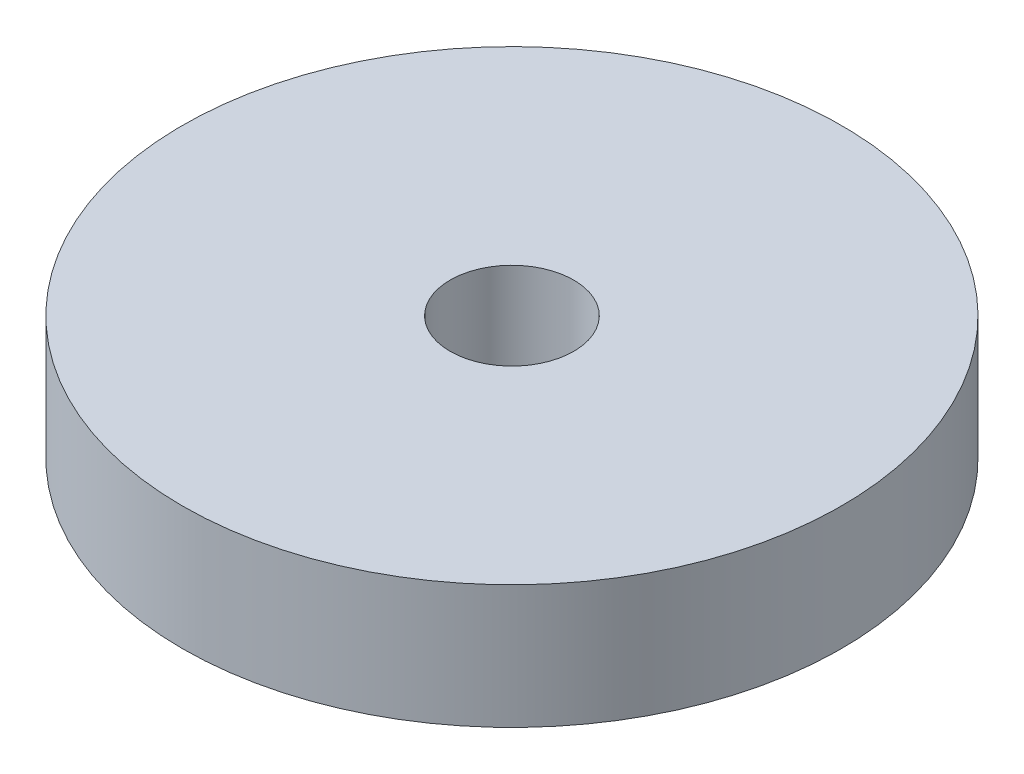
ISO-10303-21;
HEADER;
FILE_DESCRIPTION(('STEP AP214'),'2;1');
FILE_NAME('part.step','',(''),(''),'','','');
FILE_SCHEMA(('AUTOMOTIVE_DESIGN { 1 0 10303 214 1 1 1 1 }'));
ENDSEC;
DATA;
#1=APPLICATION_CONTEXT('core data for automotive mechanical design processes');
#2=APPLICATION_PROTOCOL_DEFINITION('international standard','automotive_design',2000,#1);
#3=PRODUCT_CONTEXT('',#1,'mechanical');
#4=PRODUCT('Part','Part','',(#3));
#5=PRODUCT_RELATED_PRODUCT_CATEGORY('part','',(#4));
#6=PRODUCT_DEFINITION_FORMATION('','',#4);
#7=PRODUCT_DEFINITION_CONTEXT('part definition',#1,'design');
#8=PRODUCT_DEFINITION('design','',#6,#7);
#9=PRODUCT_DEFINITION_SHAPE('','',#8);
#10=(LENGTH_UNIT() NAMED_UNIT(*) SI_UNIT(.MILLI.,.METRE.));
#11=(NAMED_UNIT(*) PLANE_ANGLE_UNIT() SI_UNIT($,.RADIAN.));
#12=(NAMED_UNIT(*) SI_UNIT($,.STERADIAN.) SOLID_ANGLE_UNIT());
#13=UNCERTAINTY_MEASURE_WITH_UNIT(LENGTH_MEASURE(1.E-05),#10,'distance_accuracy_value','');
#14=(GEOMETRIC_REPRESENTATION_CONTEXT(3) GLOBAL_UNCERTAINTY_ASSIGNED_CONTEXT((#13)) GLOBAL_UNIT_ASSIGNED_CONTEXT((#10,
#11,#12)) REPRESENTATION_CONTEXT('',''));
#15=CARTESIAN_POINT('',(0.,0.,0.));
#16=DIRECTION('',(0.,0.,1.));
#17=DIRECTION('',(1.,0.,0.));
#18=AXIS2_PLACEMENT_3D('',#15,#16,#17);
#19=CARTESIAN_POINT('',(0.,4.7625,0.));
#20=DIRECTION('',(0.,1.,0.));
#21=DIRECTION('',(0.,0.,1.));
#22=AXIS2_PLACEMENT_3D('',#19,#20,#21);
#23=PLANE('',#22);
#24=CARTESIAN_POINT('',(0.,4.7625,0.));
#25=DIRECTION('',(0.,1.,0.));
#26=DIRECTION('',(0.,0.,1.));
#27=AXIS2_PLACEMENT_3D('',#24,#25,#26);
#28=CIRCLE('',#27,25.4);
#29=CARTESIAN_POINT('',(0.,4.7625,25.4));
#30=VERTEX_POINT('',#29);
#31=EDGE_CURVE('E10',#30,#30,#28,.T.);
#32=ORIENTED_EDGE('',*,*,#31,.T.);
#33=EDGE_LOOP('',(#32));
#34=FACE_BOUND('',#33,.T.);
#35=CARTESIAN_POINT('',(0.,4.7625,0.));
#36=DIRECTION('',(0.,1.,0.));
#37=DIRECTION('',(0.,0.,1.));
#38=AXIS2_PLACEMENT_3D('',#35,#36,#37);
#39=CIRCLE('',#38,4.7625);
#40=CARTESIAN_POINT('',(0.,4.7625,4.7625));
#41=VERTEX_POINT('',#40);
#42=EDGE_CURVE('E48',#41,#41,#39,.T.);
#43=ORIENTED_EDGE('',*,*,#42,.F.);
#44=EDGE_LOOP('',(#43));
#45=FACE_BOUND('',#44,.T.);
#46=ADVANCED_FACE('F37',(#34,#45),#23,.T.);
#47=CARTESIAN_POINT('',(0.,-4.7625,0.));
#48=DIRECTION('',(0.,1.,0.));
#49=DIRECTION('',(0.,0.,1.));
#50=AXIS2_PLACEMENT_3D('',#47,#48,#49);
#51=PLANE('',#50);
#52=CARTESIAN_POINT('',(0.,-4.7625,0.));
#53=DIRECTION('',(0.,1.,0.));
#54=DIRECTION('',(0.,0.,1.));
#55=AXIS2_PLACEMENT_3D('',#52,#53,#54);
#56=CIRCLE('',#55,25.4);
#57=CARTESIAN_POINT('',(0.,-4.7625,25.4));
#58=VERTEX_POINT('',#57);
#59=EDGE_CURVE('E41',#58,#58,#56,.T.);
#60=ORIENTED_EDGE('',*,*,#59,.F.);
#61=EDGE_LOOP('',(#60));
#62=FACE_BOUND('',#61,.T.);
#63=CARTESIAN_POINT('',(0.,-4.7625,0.));
#64=DIRECTION('',(0.,1.,0.));
#65=DIRECTION('',(0.,0.,1.));
#66=AXIS2_PLACEMENT_3D('',#63,#64,#65);
#67=CIRCLE('',#66,4.7625);
#68=CARTESIAN_POINT('',(0.,-4.7625,4.7625));
#69=VERTEX_POINT('',#68);
#70=EDGE_CURVE('E50',#69,#69,#67,.T.);
#71=ORIENTED_EDGE('',*,*,#70,.T.);
#72=EDGE_LOOP('',(#71));
#73=FACE_BOUND('',#72,.T.);
#74=ADVANCED_FACE('F60',(#62,#73),#51,.F.);
#75=CARTESIAN_POINT('',(0.,4.7625,0.));
#76=DIRECTION('',(0.,-1.,0.));
#77=DIRECTION('',(0.,0.,-1.));
#78=AXIS2_PLACEMENT_3D('',#75,#76,#77);
#79=CYLINDRICAL_SURFACE('',#78,25.4);
#80=ORIENTED_EDGE('',*,*,#31,.F.);
#81=EDGE_LOOP('',(#80));
#82=FACE_BOUND('',#81,.T.);
#83=ORIENTED_EDGE('',*,*,#59,.T.);
#84=EDGE_LOOP('',(#83));
#85=FACE_BOUND('',#84,.T.);
#86=ADVANCED_FACE('F39',(#82,#85),#79,.T.);
#87=CARTESIAN_POINT('',(0.,4.7625,0.));
#88=DIRECTION('',(0.,-1.,0.));
#89=DIRECTION('',(0.,0.,-1.));
#90=AXIS2_PLACEMENT_3D('',#87,#88,#89);
#91=CYLINDRICAL_SURFACE('',#90,4.7625);
#92=ORIENTED_EDGE('',*,*,#42,.T.);
#93=EDGE_LOOP('',(#92));
#94=FACE_BOUND('',#93,.T.);
#95=ORIENTED_EDGE('',*,*,#70,.F.);
#96=EDGE_LOOP('',(#95));
#97=FACE_BOUND('',#96,.T.);
#98=ADVANCED_FACE('F56',(#94,#97),#91,.F.);
#99=CLOSED_SHELL('',(#46,#74,#86,#98));
#100=MANIFOLD_SOLID_BREP('B2',#99);
#101=ADVANCED_BREP_SHAPE_REPRESENTATION('',(#18,#100),#14);
#102=SHAPE_DEFINITION_REPRESENTATION(#9,#101);
ENDSEC;
END-ISO-10303-21;
